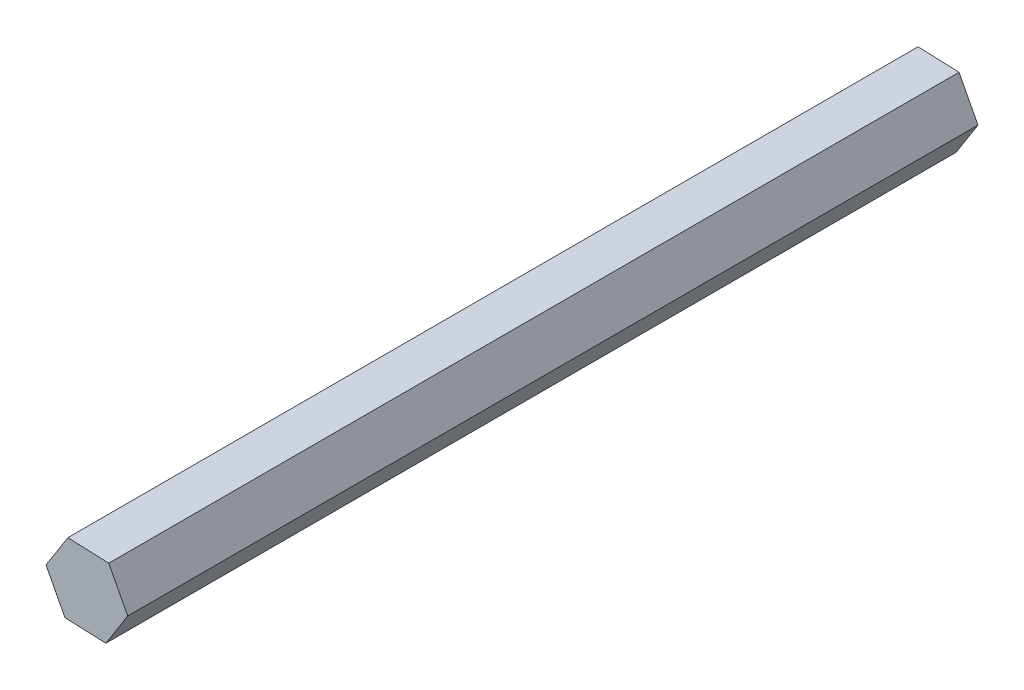
ISO-10303-21;
HEADER;
FILE_DESCRIPTION(('STEP AP214'),'2;1');
FILE_NAME('part.step','',(''),(''),'','','');
FILE_SCHEMA(('AUTOMOTIVE_DESIGN { 1 0 10303 214 1 1 1 1 }'));
ENDSEC;
DATA;
#1=APPLICATION_CONTEXT('core data for automotive mechanical design processes');
#2=APPLICATION_PROTOCOL_DEFINITION('international standard','automotive_design',2000,#1);
#3=PRODUCT_CONTEXT('',#1,'mechanical');
#4=PRODUCT('Part','Part','',(#3));
#5=PRODUCT_RELATED_PRODUCT_CATEGORY('part','',(#4));
#6=PRODUCT_DEFINITION_FORMATION('','',#4);
#7=PRODUCT_DEFINITION_CONTEXT('part definition',#1,'design');
#8=PRODUCT_DEFINITION('design','',#6,#7);
#9=PRODUCT_DEFINITION_SHAPE('','',#8);
#10=(LENGTH_UNIT() NAMED_UNIT(*) SI_UNIT(.MILLI.,.METRE.));
#11=(NAMED_UNIT(*) PLANE_ANGLE_UNIT() SI_UNIT($,.RADIAN.));
#12=(NAMED_UNIT(*) SI_UNIT($,.STERADIAN.) SOLID_ANGLE_UNIT());
#13=UNCERTAINTY_MEASURE_WITH_UNIT(LENGTH_MEASURE(1.E-05),#10,'distance_accuracy_value','');
#14=(GEOMETRIC_REPRESENTATION_CONTEXT(3) GLOBAL_UNCERTAINTY_ASSIGNED_CONTEXT((#13)) GLOBAL_UNIT_ASSIGNED_CONTEXT((#10,
#11,#12)) REPRESENTATION_CONTEXT('',''));
#15=CARTESIAN_POINT('',(0.,0.,0.));
#16=DIRECTION('',(0.,0.,1.));
#17=DIRECTION('',(1.,0.,0.));
#18=AXIS2_PLACEMENT_3D('',#15,#16,#17);
#19=CARTESIAN_POINT('',(6.80511601481354,-12.9901396974113,304.8));
#20=DIRECTION('',(-0.844782086570363,0.535110480377486,0.));
#21=DIRECTION('',(-0.535110480377486,-0.844782086570363,0.));
#22=AXIS2_PLACEMENT_3D('',#19,#20,#21);
#23=PLANE('',#22);
#24=DIRECTION('',(0.535110480377486,0.844782086570363,0.));
#25=VECTOR('',#24,1.);
#26=CARTESIAN_POINT('',(6.80511601481354,-12.9901396974113,0.));
#27=LINE('',#26,#25);
#28=CARTESIAN_POINT('',(6.80511601481354,-12.9901396974113,0.));
#29=VERTEX_POINT('',#28);
#30=CARTESIAN_POINT('',(14.6523489840737,-0.601666504176813,0.));
#31=VERTEX_POINT('',#30);
#32=EDGE_CURVE('E117',#29,#31,#27,.T.);
#33=ORIENTED_EDGE('',*,*,#32,.T.);
#34=DIRECTION('',(0.,0.,-1.));
#35=VECTOR('',#34,1.);
#36=CARTESIAN_POINT('',(14.6523489840737,-0.601666504176813,304.8));
#37=LINE('',#36,#35);
#38=CARTESIAN_POINT('',(14.6523489840737,-0.601666504176813,304.8));
#39=VERTEX_POINT('',#38);
#40=EDGE_CURVE('E11',#39,#31,#37,.T.);
#41=ORIENTED_EDGE('',*,*,#40,.F.);
#42=DIRECTION('',(0.535110480377486,0.844782086570363,0.));
#43=VECTOR('',#42,1.);
#44=CARTESIAN_POINT('',(6.80511601481354,-12.9901396974113,304.8));
#45=LINE('',#44,#43);
#46=CARTESIAN_POINT('',(6.80511601481354,-12.9901396974113,304.8));
#47=VERTEX_POINT('',#46);
#48=EDGE_CURVE('E127',#47,#39,#45,.T.);
#49=ORIENTED_EDGE('',*,*,#48,.F.);
#50=DIRECTION('',(0.,0.,-1.));
#51=VECTOR('',#50,1.);
#52=CARTESIAN_POINT('',(6.80511601481354,-12.9901396974113,304.8));
#53=LINE('',#52,#51);
#54=EDGE_CURVE('E113',#47,#29,#53,.T.);
#55=ORIENTED_EDGE('',*,*,#54,.T.);
#56=EDGE_LOOP('',(#33,#41,#49,#55));
#57=FACE_BOUND('',#56,.T.);
#58=ADVANCED_FACE('F33',(#57),#23,.F.);
#59=CARTESIAN_POINT('',(14.6523489840737,-0.601666504176813,304.8));
#60=DIRECTION('',(-0.885810313123379,-0.464047507443217,0.));
#61=DIRECTION('',(0.464047507443217,-0.885810313123379,0.));
#62=AXIS2_PLACEMENT_3D('',#59,#60,#61);
#63=PLANE('',#62);
#64=DIRECTION('',(-0.464047507443216,0.885810313123378,0.));
#65=VECTOR('',#64,1.);
#66=CARTESIAN_POINT('',(14.6523489840737,-0.601666504176813,0.));
#67=LINE('',#66,#65);
#68=CARTESIAN_POINT('',(7.84723296926013,12.3884731932345,0.));
#69=VERTEX_POINT('',#68);
#70=EDGE_CURVE('E120',#31,#69,#67,.T.);
#71=ORIENTED_EDGE('',*,*,#70,.T.);
#72=DIRECTION('',(0.,0.,-1.));
#73=VECTOR('',#72,1.);
#74=CARTESIAN_POINT('',(7.84723296926013,12.3884731932345,304.8));
#75=LINE('',#74,#73);
#76=CARTESIAN_POINT('',(7.84723296926013,12.3884731932345,304.8));
#77=VERTEX_POINT('',#76);
#78=EDGE_CURVE('E41',#77,#69,#75,.T.);
#79=ORIENTED_EDGE('',*,*,#78,.F.);
#80=DIRECTION('',(-0.464047507443216,0.885810313123378,0.));
#81=VECTOR('',#80,1.);
#82=CARTESIAN_POINT('',(14.6523489840737,-0.601666504176813,304.8));
#83=LINE('',#82,#81);
#84=EDGE_CURVE('E86',#39,#77,#83,.T.);
#85=ORIENTED_EDGE('',*,*,#84,.F.);
#86=ORIENTED_EDGE('',*,*,#40,.T.);
#87=EDGE_LOOP('',(#71,#79,#85,#86));
#88=FACE_BOUND('',#87,.T.);
#89=ADVANCED_FACE('F151',(#88),#63,.F.);
#90=CARTESIAN_POINT('',(7.84723296926013,12.3884731932345,304.8));
#91=DIRECTION('',(-0.0410282265530158,-0.999157987820702,0.));
#92=DIRECTION('',(0.999157987820702,-0.0410282265530158,0.));
#93=AXIS2_PLACEMENT_3D('',#90,#91,#92);
#94=PLANE('',#93);
#95=DIRECTION('',(-0.999157987820702,0.0410282265530158,0.));
#96=VECTOR('',#95,1.);
#97=CARTESIAN_POINT('',(7.84723296926013,12.3884731932345,0.));
#98=LINE('',#97,#96);
#99=CARTESIAN_POINT('',(-6.80511601481354,12.9901396974113,0.));
#100=VERTEX_POINT('',#99);
#101=EDGE_CURVE('E122',#69,#100,#98,.T.);
#102=ORIENTED_EDGE('',*,*,#101,.T.);
#103=DIRECTION('',(0.,0.,-1.));
#104=VECTOR('',#103,1.);
#105=CARTESIAN_POINT('',(-6.80511601481354,12.9901396974113,304.8));
#106=LINE('',#105,#104);
#107=CARTESIAN_POINT('',(-6.80511601481354,12.9901396974113,304.8));
#108=VERTEX_POINT('',#107);
#109=EDGE_CURVE('E108',#108,#100,#106,.T.);
#110=ORIENTED_EDGE('',*,*,#109,.F.);
#111=DIRECTION('',(-0.999157987820702,0.0410282265530158,0.));
#112=VECTOR('',#111,1.);
#113=CARTESIAN_POINT('',(7.84723296926013,12.3884731932345,304.8));
#114=LINE('',#113,#112);
#115=EDGE_CURVE('E99',#77,#108,#114,.T.);
#116=ORIENTED_EDGE('',*,*,#115,.F.);
#117=ORIENTED_EDGE('',*,*,#78,.T.);
#118=EDGE_LOOP('',(#102,#110,#116,#117));
#119=FACE_BOUND('',#118,.T.);
#120=ADVANCED_FACE('F133',(#119),#94,.F.);
#121=CARTESIAN_POINT('',(-6.80511601481354,12.9901396974113,304.8));
#122=DIRECTION('',(0.844782086570363,-0.535110480377486,0.));
#123=DIRECTION('',(0.535110480377486,0.844782086570363,0.));
#124=AXIS2_PLACEMENT_3D('',#121,#122,#123);
#125=PLANE('',#124);
#126=DIRECTION('',(-0.535110480377486,-0.844782086570363,0.));
#127=VECTOR('',#126,1.);
#128=CARTESIAN_POINT('',(-6.80511601481354,12.9901396974113,0.));
#129=LINE('',#128,#127);
#130=CARTESIAN_POINT('',(-14.6523489840737,0.601666504176813,0.));
#131=VERTEX_POINT('',#130);
#132=EDGE_CURVE('E107',#100,#131,#129,.T.);
#133=ORIENTED_EDGE('',*,*,#132,.T.);
#134=DIRECTION('',(0.,0.,-1.));
#135=VECTOR('',#134,1.);
#136=CARTESIAN_POINT('',(-14.6523489840737,0.601666504176813,304.8));
#137=LINE('',#136,#135);
#138=CARTESIAN_POINT('',(-14.6523489840737,0.601666504176813,304.8));
#139=VERTEX_POINT('',#138);
#140=EDGE_CURVE('E104',#139,#131,#137,.T.);
#141=ORIENTED_EDGE('',*,*,#140,.F.);
#142=DIRECTION('',(-0.535110480377486,-0.844782086570363,0.));
#143=VECTOR('',#142,1.);
#144=CARTESIAN_POINT('',(-6.80511601481354,12.9901396974113,304.8));
#145=LINE('',#144,#143);
#146=EDGE_CURVE('E93',#108,#139,#145,.T.);
#147=ORIENTED_EDGE('',*,*,#146,.F.);
#148=ORIENTED_EDGE('',*,*,#109,.T.);
#149=EDGE_LOOP('',(#133,#141,#147,#148));
#150=FACE_BOUND('',#149,.T.);
#151=ADVANCED_FACE('F105',(#150),#125,.F.);
#152=CARTESIAN_POINT('',(-14.6523489840737,0.601666504176813,304.8));
#153=DIRECTION('',(0.885810313123379,0.464047507443216,0.));
#154=DIRECTION('',(-0.464047507443216,0.885810313123379,0.));
#155=AXIS2_PLACEMENT_3D('',#152,#153,#154);
#156=PLANE('',#155);
#157=DIRECTION('',(0.464047507443216,-0.885810313123379,0.));
#158=VECTOR('',#157,1.);
#159=CARTESIAN_POINT('',(-14.6523489840737,0.601666504176813,0.));
#160=LINE('',#159,#158);
#161=CARTESIAN_POINT('',(-7.84723296926014,-12.3884731932345,0.));
#162=VERTEX_POINT('',#161);
#163=EDGE_CURVE('E72',#131,#162,#160,.T.);
#164=ORIENTED_EDGE('',*,*,#163,.T.);
#165=DIRECTION('',(0.,0.,-1.));
#166=VECTOR('',#165,1.);
#167=CARTESIAN_POINT('',(-7.84723296926014,-12.3884731932345,304.8));
#168=LINE('',#167,#166);
#169=CARTESIAN_POINT('',(-7.84723296926014,-12.3884731932345,304.8));
#170=VERTEX_POINT('',#169);
#171=EDGE_CURVE('E109',#170,#162,#168,.T.);
#172=ORIENTED_EDGE('',*,*,#171,.F.);
#173=DIRECTION('',(0.464047507443216,-0.885810313123379,0.));
#174=VECTOR('',#173,1.);
#175=CARTESIAN_POINT('',(-14.6523489840737,0.601666504176813,304.8));
#176=LINE('',#175,#174);
#177=EDGE_CURVE('E97',#139,#170,#176,.T.);
#178=ORIENTED_EDGE('',*,*,#177,.F.);
#179=ORIENTED_EDGE('',*,*,#140,.T.);
#180=EDGE_LOOP('',(#164,#172,#178,#179));
#181=FACE_BOUND('',#180,.T.);
#182=ADVANCED_FACE('F111',(#181),#156,.F.);
#183=CARTESIAN_POINT('',(-7.84723296926014,-12.3884731932345,304.8));
#184=DIRECTION('',(0.041028226553016,0.999157987820702,0.));
#185=DIRECTION('',(-0.999157987820702,0.041028226553016,0.));
#186=AXIS2_PLACEMENT_3D('',#183,#184,#185);
#187=PLANE('',#186);
#188=DIRECTION('',(0.999157987820702,-0.041028226553016,0.));
#189=VECTOR('',#188,1.);
#190=CARTESIAN_POINT('',(-7.84723296926014,-12.3884731932345,0.));
#191=LINE('',#190,#189);
#192=EDGE_CURVE('E78',#162,#29,#191,.T.);
#193=ORIENTED_EDGE('',*,*,#192,.T.);
#194=ORIENTED_EDGE('',*,*,#54,.F.);
#195=DIRECTION('',(0.999157987820702,-0.041028226553016,0.));
#196=VECTOR('',#195,1.);
#197=CARTESIAN_POINT('',(-7.84723296926014,-12.3884731932345,304.8));
#198=LINE('',#197,#196);
#199=EDGE_CURVE('E49',#170,#47,#198,.T.);
#200=ORIENTED_EDGE('',*,*,#199,.F.);
#201=ORIENTED_EDGE('',*,*,#171,.T.);
#202=EDGE_LOOP('',(#193,#194,#200,#201));
#203=FACE_BOUND('',#202,.T.);
#204=ADVANCED_FACE('F140',(#203),#187,.F.);
#205=CARTESIAN_POINT('',(0.,0.,304.8));
#206=DIRECTION('',(0.,0.,1.));
#207=DIRECTION('',(1.,0.,0.));
#208=AXIS2_PLACEMENT_3D('',#205,#206,#207);
#209=PLANE('',#208);
#210=ORIENTED_EDGE('',*,*,#48,.T.);
#211=ORIENTED_EDGE('',*,*,#84,.T.);
#212=ORIENTED_EDGE('',*,*,#115,.T.);
#213=ORIENTED_EDGE('',*,*,#146,.T.);
#214=ORIENTED_EDGE('',*,*,#177,.T.);
#215=ORIENTED_EDGE('',*,*,#199,.T.);
#216=EDGE_LOOP('',(#210,#211,#212,#213,#214,#215));
#217=FACE_BOUND('',#216,.T.);
#218=ADVANCED_FACE('F95',(#217),#209,.T.);
#219=CARTESIAN_POINT('',(0.,0.,0.));
#220=DIRECTION('',(0.,0.,1.));
#221=DIRECTION('',(1.,0.,0.));
#222=AXIS2_PLACEMENT_3D('',#219,#220,#221);
#223=PLANE('',#222);
#224=ORIENTED_EDGE('',*,*,#32,.F.);
#225=ORIENTED_EDGE('',*,*,#192,.F.);
#226=ORIENTED_EDGE('',*,*,#163,.F.);
#227=ORIENTED_EDGE('',*,*,#132,.F.);
#228=ORIENTED_EDGE('',*,*,#101,.F.);
#229=ORIENTED_EDGE('',*,*,#70,.F.);
#230=EDGE_LOOP('',(#224,#225,#226,#227,#228,#229));
#231=FACE_BOUND('',#230,.T.);
#232=ADVANCED_FACE('F136',(#231),#223,.F.);
#233=CLOSED_SHELL('',(#58,#89,#120,#151,#182,#204,#218,#232));
#234=MANIFOLD_SOLID_BREP('B2',#233);
#235=ADVANCED_BREP_SHAPE_REPRESENTATION('',(#18,#234),#14);
#236=SHAPE_DEFINITION_REPRESENTATION(#9,#235);
ENDSEC;
END-ISO-10303-21;
